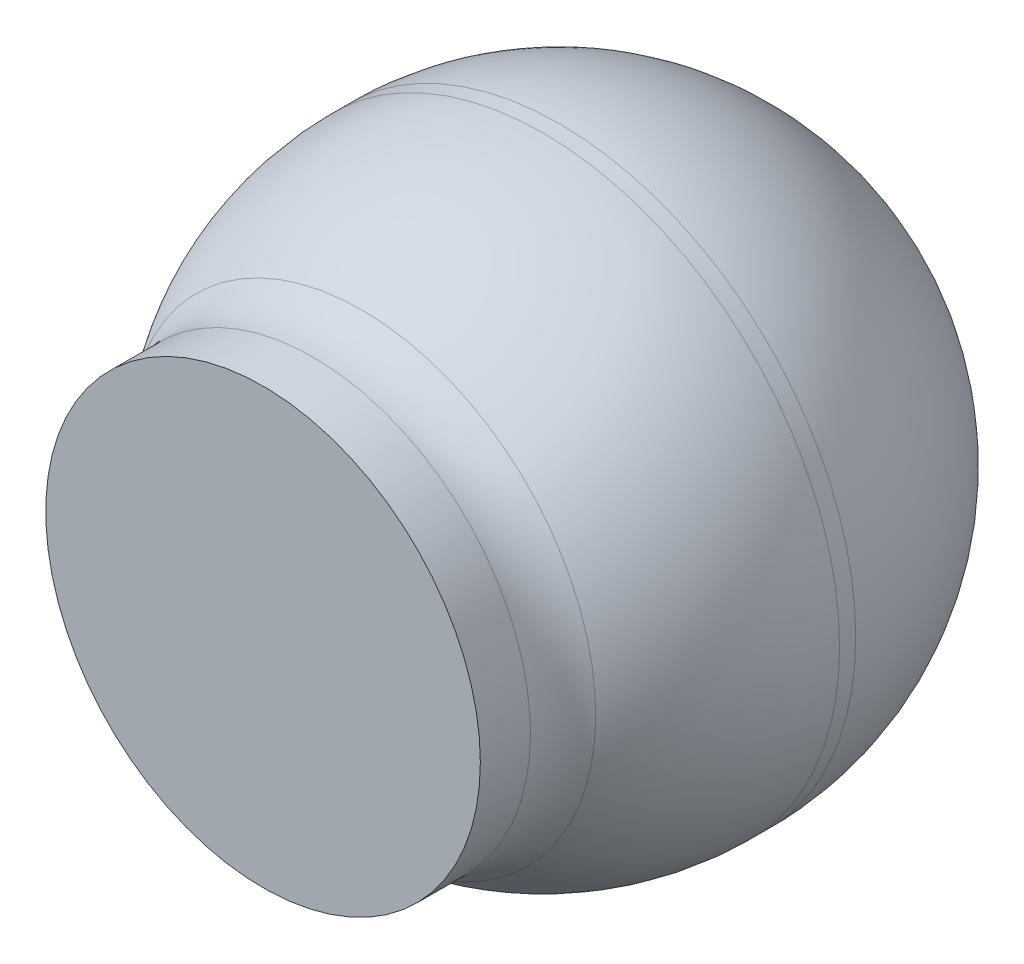
ISO-10303-21;
HEADER;
FILE_DESCRIPTION(('STEP AP214'),'2;1');
FILE_NAME('part.step','',(''),(''),'','','');
FILE_SCHEMA(('AUTOMOTIVE_DESIGN { 1 0 10303 214 1 1 1 1 }'));
ENDSEC;
DATA;
#1=APPLICATION_CONTEXT('core data for automotive mechanical design processes');
#2=APPLICATION_PROTOCOL_DEFINITION('international standard','automotive_design',2000,#1);
#3=PRODUCT_CONTEXT('',#1,'mechanical');
#4=PRODUCT('Part','Part','',(#3));
#5=PRODUCT_RELATED_PRODUCT_CATEGORY('part','',(#4));
#6=PRODUCT_DEFINITION_FORMATION('','',#4);
#7=PRODUCT_DEFINITION_CONTEXT('part definition',#1,'design');
#8=PRODUCT_DEFINITION('design','',#6,#7);
#9=PRODUCT_DEFINITION_SHAPE('','',#8);
#10=(LENGTH_UNIT() NAMED_UNIT(*) SI_UNIT(.MILLI.,.METRE.));
#11=(NAMED_UNIT(*) PLANE_ANGLE_UNIT() SI_UNIT($,.RADIAN.));
#12=(NAMED_UNIT(*) SI_UNIT($,.STERADIAN.) SOLID_ANGLE_UNIT());
#13=UNCERTAINTY_MEASURE_WITH_UNIT(LENGTH_MEASURE(1.E-05),#10,'distance_accuracy_value','');
#14=(GEOMETRIC_REPRESENTATION_CONTEXT(3) GLOBAL_UNCERTAINTY_ASSIGNED_CONTEXT((#13)) GLOBAL_UNIT_ASSIGNED_CONTEXT((#10,
#11,#12)) REPRESENTATION_CONTEXT('',''));
#15=CARTESIAN_POINT('',(0.,0.,0.));
#16=DIRECTION('',(0.,0.,1.));
#17=DIRECTION('',(1.,0.,0.));
#18=AXIS2_PLACEMENT_3D('',#15,#16,#17);
#19=CARTESIAN_POINT('',(-6.912919922269,-4.051349291452,10.006534503384));
#20=DIRECTION('',(0.,0.,-1.));
#21=DIRECTION('',(-1.,0.,0.));
#22=AXIS2_PLACEMENT_3D('',#19,#20,#21);
#23=PLANE('',#22);
#24=CARTESIAN_POINT('',(-6.912919922269,-4.051349291452,10.006534503384));
#25=DIRECTION('',(0.,0.,1.));
#26=DIRECTION('',(1.,0.,0.));
#27=AXIS2_PLACEMENT_3D('',#24,#25,#26);
#28=CIRCLE('',#27,0.275);
#29=CARTESIAN_POINT('',(-6.637919922269,-4.051349291452,10.006534503384));
#30=VERTEX_POINT('',#29);
#31=EDGE_CURVE('E20',#30,#30,#28,.F.);
#32=ORIENTED_EDGE('',*,*,#31,.F.);
#33=EDGE_LOOP('',(#32));
#34=FACE_BOUND('',#33,.T.);
#35=ADVANCED_FACE('F17',(#34),#23,.F.);
#36=CARTESIAN_POINT('',(-6.912919922269,-4.051349291452,9.906534503384));
#37=DIRECTION('',(0.,0.,1.));
#38=DIRECTION('',(1.,0.,0.));
#39=AXIS2_PLACEMENT_3D('',#36,#37,#38);
#40=CYLINDRICAL_SURFACE('',#39,0.275);
#41=CARTESIAN_POINT('',(-6.912919922269,-4.051349291452,9.943180457728));
#42=DIRECTION('',(0.,0.,-1.));
#43=DIRECTION('',(0.996700902337583,0.0811622527992439,0.));
#44=AXIS2_PLACEMENT_3D('',#41,#42,#43);
#45=CIRCLE('',#44,0.275);
#46=CARTESIAN_POINT('',(-6.63882717412617,-4.02902967193221,9.943180457728));
#47=VERTEX_POINT('',#46);
#48=EDGE_CURVE('E65',#47,#47,#45,.F.);
#49=ORIENTED_EDGE('',*,*,#48,.T.);
#50=EDGE_LOOP('',(#49));
#51=FACE_BOUND('',#50,.T.);
#52=ORIENTED_EDGE('',*,*,#31,.T.);
#53=EDGE_LOOP('',(#52));
#54=FACE_BOUND('',#53,.T.);
#55=ADVANCED_FACE('F62',(#51,#54),#40,.T.);
#56=CARTESIAN_POINT('',(-6.912919922269,-4.051349291452,9.943180457728));
#57=DIRECTION('',(0.,0.,-1.));
#58=DIRECTION('',(0.996700902337583,0.0811622527992448,0.));
#59=AXIS2_PLACEMENT_3D('',#56,#57,#58);
#60=TOROIDAL_SURFACE('',#59,0.375,0.1);
#61=ORIENTED_EDGE('',*,*,#48,.F.);
#62=EDGE_LOOP('',(#61));
#63=FACE_BOUND('',#62,.T.);
#64=CARTESIAN_POINT('',(-6.912919922269,-4.051349291452,9.881744931236));
#65=DIRECTION('',(0.,0.,-1.));
#66=DIRECTION('',(-0.996700902337598,-0.0811622527990593,0.));
#67=AXIS2_PLACEMENT_3D('',#64,#65,#66);
#68=CIRCLE('',#67,0.296097046412665);
#69=CARTESIAN_POINT('',(-7.208040115608,-4.075381194786,9.881744931236));
#70=VERTEX_POINT('',#69);
#71=EDGE_CURVE('E39',#70,#70,#68,.T.);
#72=ORIENTED_EDGE('',*,*,#71,.F.);
#73=EDGE_LOOP('',(#72));
#74=FACE_BOUND('',#73,.T.);
#75=ADVANCED_FACE('F57',(#63,#74),#60,.F.);
#76=CARTESIAN_POINT('',(-7.286682760645,-4.081785136252,9.651976062157));
#77=CARTESIAN_POINT('',(-7.286682760645,-4.081785136252,9.701461392103));
#78=CARTESIAN_POINT('',(-7.278526217348,-4.081120941579,9.750947004335));
#79=CARTESIAN_POINT('',(-7.262207085349,-4.079792059952,9.798626332798));
#80=CARTESIAN_POINT('',(-7.238341390838,-4.077848654938,9.842699544317));
#81=CARTESIAN_POINT('',(-7.208040115608,-4.075381194786,9.881744931236));
#82=(BOUNDED_CURVE() B_SPLINE_CURVE(5,(#76,#77,#78,#79,#80,#81),.UNSPECIFIED.,.F.,
.F.) B_SPLINE_CURVE_WITH_KNOTS((6,6),(0.,0.661568582165),
.UNSPECIFIED.) CURVE() GEOMETRIC_REPRESENTATION_ITEM() RATIONAL_B_SPLINE_CURVE((1.,1.,1.,1.,1.,1.)) REPRESENTATION_ITEM(''));
#83=CARTESIAN_POINT('',(-6.912919922269,-4.051349291452,9.651976062157));
#84=DIRECTION('',(0.,0.,-1.));
#85=AXIS1_PLACEMENT('',#83,#84);
#86=SURFACE_OF_REVOLUTION('',#82,#85);
#87=CARTESIAN_POINT('',(-6.912919922269,-4.051349291452,9.651976062157));
#88=DIRECTION('',(0.,0.,1.));
#89=DIRECTION('',(1.,0.,0.));
#90=AXIS2_PLACEMENT_3D('',#87,#88,#89);
#91=CIRCLE('',#90,0.375);
#92=CARTESIAN_POINT('',(-6.537919922269,-4.051349291452,9.651976062157));
#93=VERTEX_POINT('',#92);
#94=EDGE_CURVE('E36',#93,#93,#91,.F.);
#95=ORIENTED_EDGE('',*,*,#94,.F.);
#96=EDGE_LOOP('',(#95));
#97=FACE_BOUND('',#96,.T.);
#98=ORIENTED_EDGE('',*,*,#71,.T.);
#99=EDGE_LOOP('',(#98));
#100=FACE_BOUND('',#99,.T.);
#101=ADVANCED_FACE('F53',(#97,#100),#86,.F.);
#102=CARTESIAN_POINT('',(-6.912919922269,-4.051349291452,9.256534503384));
#103=DIRECTION('',(0.,0.,1.));
#104=DIRECTION('',(1.,0.,0.));
#105=AXIS2_PLACEMENT_3D('',#102,#103,#104);
#106=CYLINDRICAL_SURFACE('',#105,0.375);
#107=CARTESIAN_POINT('',(-6.912919922269,-4.051349291452,9.631534503384));
#108=DIRECTION('',(0.,0.,-1.));
#109=DIRECTION('',(0.0811622527992357,-0.996700902337583,0.));
#110=AXIS2_PLACEMENT_3D('',#107,#108,#109);
#111=CIRCLE('',#110,0.375);
#112=CARTESIAN_POINT('',(-6.88248407746929,-4.42511212982859,9.631534503384));
#113=VERTEX_POINT('',#112);
#114=CARTESIAN_POINT('',(-6.94335576706871,-3.67758645307541,9.631534503384));
#115=VERTEX_POINT('',#114);
#116=EDGE_CURVE('E11',#113,#115,#111,.T.);
#117=ORIENTED_EDGE('',*,*,#116,.F.);
#118=CARTESIAN_POINT('',(-6.912919922269,-4.051349291452,9.631534503384));
#119=DIRECTION('',(0.,0.,1.));
#120=DIRECTION('',(0.0811622527992365,-0.996700902337583,0.));
#121=AXIS2_PLACEMENT_3D('',#118,#119,#120);
#122=CIRCLE('',#121,0.375);
#123=EDGE_CURVE('E25',#115,#113,#122,.F.);
#124=ORIENTED_EDGE('',*,*,#123,.F.);
#125=EDGE_LOOP('',(#117,#124));
#126=FACE_BOUND('',#125,.T.);
#127=ORIENTED_EDGE('',*,*,#94,.T.);
#128=EDGE_LOOP('',(#127));
#129=FACE_BOUND('',#128,.T.);
#130=ADVANCED_FACE('F34',(#126,#129),#106,.T.);
#131=CARTESIAN_POINT('',(-6.912919922269,-4.051349291452,9.631534503384));
#132=DIRECTION('',(0.0811622527992361,-0.996700902337583,0.));
#133=DIRECTION('',(-0.996700902337583,-0.0811622527992361,0.));
#134=AXIS2_PLACEMENT_3D('',#131,#132,#133);
#135=SPHERICAL_SURFACE('',#134,0.375);
#136=ORIENTED_EDGE('',*,*,#123,.T.);
#137=ORIENTED_EDGE('',*,*,#116,.T.);
#138=EDGE_LOOP('',(#136,#137));
#139=FACE_BOUND('',#138,.T.);
#140=ADVANCED_FACE('F32',(#139),#135,.T.);
#141=CLOSED_SHELL('',(#35,#55,#75,#101,#130,#140));
#142=MANIFOLD_SOLID_BREP('B1',#141);
#143=ADVANCED_BREP_SHAPE_REPRESENTATION('',(#18,#142),#14);
#144=SHAPE_DEFINITION_REPRESENTATION(#9,#143);
ENDSEC;
END-ISO-10303-21;
